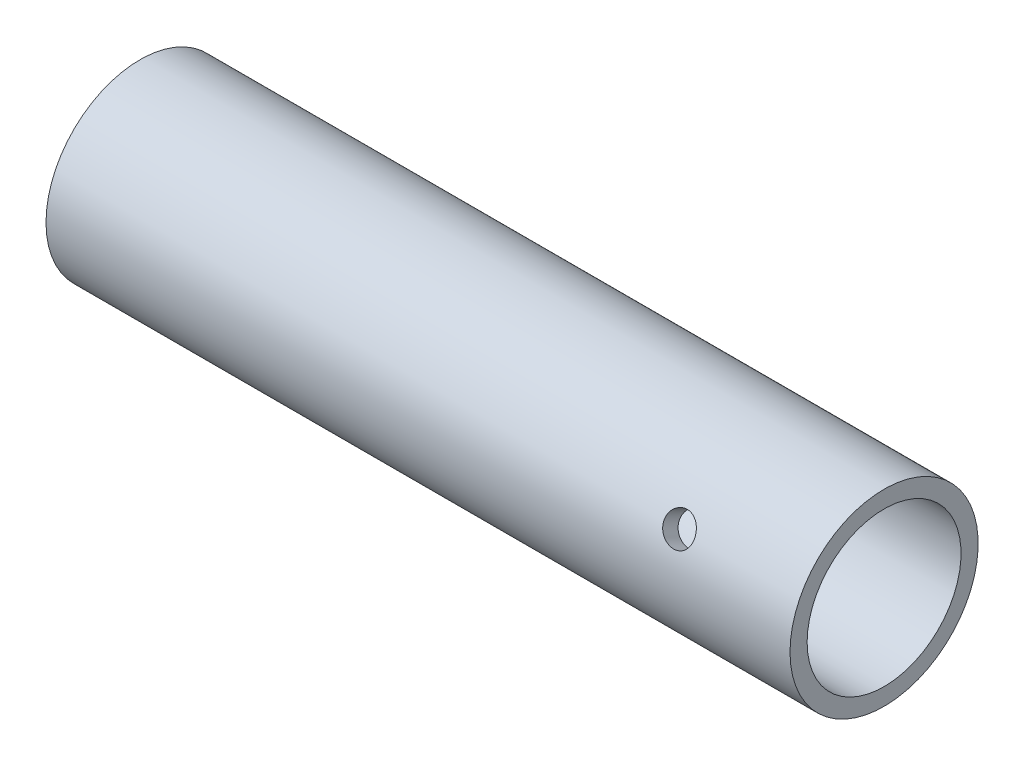
ISO-10303-21;
HEADER;
FILE_DESCRIPTION(('STEP AP214'),'2;1');
FILE_NAME('part.step','',(''),(''),'','','');
FILE_SCHEMA(('AUTOMOTIVE_DESIGN { 1 0 10303 214 1 1 1 1 }'));
ENDSEC;
DATA;
#1=APPLICATION_CONTEXT('core data for automotive mechanical design processes');
#2=APPLICATION_PROTOCOL_DEFINITION('international standard','automotive_design',2000,#1);
#3=PRODUCT_CONTEXT('',#1,'mechanical');
#4=PRODUCT('Part','Part','',(#3));
#5=PRODUCT_RELATED_PRODUCT_CATEGORY('part','',(#4));
#6=PRODUCT_DEFINITION_FORMATION('','',#4);
#7=PRODUCT_DEFINITION_CONTEXT('part definition',#1,'design');
#8=PRODUCT_DEFINITION('design','',#6,#7);
#9=PRODUCT_DEFINITION_SHAPE('','',#8);
#10=(LENGTH_UNIT() NAMED_UNIT(*) SI_UNIT(.MILLI.,.METRE.));
#11=(NAMED_UNIT(*) PLANE_ANGLE_UNIT() SI_UNIT($,.RADIAN.));
#12=(NAMED_UNIT(*) SI_UNIT($,.STERADIAN.) SOLID_ANGLE_UNIT());
#13=UNCERTAINTY_MEASURE_WITH_UNIT(LENGTH_MEASURE(1.E-05),#10,'distance_accuracy_value','');
#14=(GEOMETRIC_REPRESENTATION_CONTEXT(3) GLOBAL_UNCERTAINTY_ASSIGNED_CONTEXT((#13)) GLOBAL_UNIT_ASSIGNED_CONTEXT((#10,
#11,#12)) REPRESENTATION_CONTEXT('',''));
#15=CARTESIAN_POINT('',(0.,0.,0.));
#16=DIRECTION('',(0.,0.,1.));
#17=DIRECTION('',(1.,0.,0.));
#18=AXIS2_PLACEMENT_3D('',#15,#16,#17);
#19=CARTESIAN_POINT('',(261.558388757778,0.,0.));
#20=DIRECTION('',(-1.,0.,0.));
#21=DIRECTION('',(0.,0.,1.));
#22=AXIS2_PLACEMENT_3D('',#19,#20,#21);
#23=PLANE('',#22);
#24=CARTESIAN_POINT('',(261.558388757778,-148.573704322227,0.));
#25=DIRECTION('',(-1.,0.,0.));
#26=DIRECTION('',(0.,0.,1.));
#27=AXIS2_PLACEMENT_3D('',#24,#25,#26);
#28=CIRCLE('',#27,5.50000000000001);
#29=CARTESIAN_POINT('',(261.558388757778,-148.573704322227,5.50000000000001));
#30=VERTEX_POINT('',#29);
#31=EDGE_CURVE('E140',#30,#30,#28,.T.);
#32=ORIENTED_EDGE('',*,*,#31,.T.);
#33=EDGE_LOOP('',(#32));
#34=FACE_BOUND('',#33,.T.);
#35=CARTESIAN_POINT('',(261.558388757778,-148.573704322227,0.));
#36=DIRECTION('',(-1.,0.,0.));
#37=DIRECTION('',(0.,0.,1.));
#38=AXIS2_PLACEMENT_3D('',#35,#36,#37);
#39=CIRCLE('',#38,0.5);
#40=CARTESIAN_POINT('',(261.558388757778,-148.573704322227,0.5));
#41=VERTEX_POINT('',#40);
#42=EDGE_CURVE('E51',#41,#41,#39,.T.);
#43=ORIENTED_EDGE('',*,*,#42,.F.);
#44=EDGE_LOOP('',(#43));
#45=FACE_BOUND('',#44,.T.);
#46=ADVANCED_FACE('F38',(#34,#45),#23,.T.);
#47=CARTESIAN_POINT('',(263.058388757778,-148.573704322227,0.));
#48=DIRECTION('',(-1.,0.,0.));
#49=DIRECTION('',(0.,0.,1.));
#50=AXIS2_PLACEMENT_3D('',#47,#48,#49);
#51=CYLINDRICAL_SURFACE('',#50,0.5);
#52=ORIENTED_EDGE('',*,*,#42,.T.);
#53=EDGE_LOOP('',(#52));
#54=FACE_BOUND('',#53,.T.);
#55=CARTESIAN_POINT('',(263.058388757778,-148.573704322227,0.));
#56=DIRECTION('',(-1.,0.,0.));
#57=DIRECTION('',(0.,0.,1.));
#58=AXIS2_PLACEMENT_3D('',#55,#56,#57);
#59=CIRCLE('',#58,0.5);
#60=CARTESIAN_POINT('',(263.058388757778,-148.573704322227,0.5));
#61=VERTEX_POINT('',#60);
#62=EDGE_CURVE('E57',#61,#61,#59,.T.);
#63=ORIENTED_EDGE('',*,*,#62,.F.);
#64=EDGE_LOOP('',(#63));
#65=FACE_BOUND('',#64,.T.);
#66=ADVANCED_FACE('F105',(#54,#65),#51,.F.);
#67=CARTESIAN_POINT('',(263.058388757778,0.,0.));
#68=DIRECTION('',(-1.,0.,0.));
#69=DIRECTION('',(0.,0.,1.));
#70=AXIS2_PLACEMENT_3D('',#67,#68,#69);
#71=PLANE('',#70);
#72=CARTESIAN_POINT('',(263.058388757778,-148.573704322227,0.));
#73=DIRECTION('',(-1.,0.,0.));
#74=DIRECTION('',(0.,0.,1.));
#75=AXIS2_PLACEMENT_3D('',#72,#73,#74);
#76=CIRCLE('',#75,4.);
#77=CARTESIAN_POINT('',(263.058388757778,-148.573704322227,4.));
#78=VERTEX_POINT('',#77);
#79=EDGE_CURVE('E119',#78,#78,#76,.T.);
#80=ORIENTED_EDGE('',*,*,#79,.F.);
#81=EDGE_LOOP('',(#80));
#82=FACE_BOUND('',#81,.T.);
#83=ORIENTED_EDGE('',*,*,#62,.T.);
#84=EDGE_LOOP('',(#83));
#85=FACE_BOUND('',#84,.T.);
#86=ADVANCED_FACE('F102',(#82,#85),#71,.F.);
#87=CARTESIAN_POINT('',(263.058388757778,-148.573704322227,0.));
#88=DIRECTION('',(-1.,0.,0.));
#89=DIRECTION('',(0.,0.,1.));
#90=AXIS2_PLACEMENT_3D('',#87,#88,#89);
#91=CYLINDRICAL_SURFACE('',#90,4.);
#92=CARTESIAN_POINT('',(295.058388757778,-148.573704322227,0.));
#93=DIRECTION('',(-1.,0.,0.));
#94=DIRECTION('',(0.,0.,1.));
#95=AXIS2_PLACEMENT_3D('',#92,#93,#94);
#96=CIRCLE('',#95,4.);
#97=CARTESIAN_POINT('',(295.058388757778,-148.573704322227,4.));
#98=VERTEX_POINT('',#97);
#99=EDGE_CURVE('E124',#98,#98,#96,.T.);
#100=ORIENTED_EDGE('',*,*,#99,.F.);
#101=EDGE_LOOP('',(#100));
#102=FACE_BOUND('',#101,.T.);
#103=ORIENTED_EDGE('',*,*,#79,.T.);
#104=EDGE_LOOP('',(#103));
#105=FACE_BOUND('',#104,.T.);
#106=ADVANCED_FACE('F98',(#102,#105),#91,.F.);
#107=CARTESIAN_POINT('',(295.058388757778,0.,0.));
#108=DIRECTION('',(-1.,0.,0.));
#109=DIRECTION('',(0.,0.,1.));
#110=AXIS2_PLACEMENT_3D('',#107,#108,#109);
#111=PLANE('',#110);
#112=CARTESIAN_POINT('',(295.058388757778,-148.573704322227,0.));
#113=DIRECTION('',(-1.,0.,0.));
#114=DIRECTION('',(0.,0.,1.));
#115=AXIS2_PLACEMENT_3D('',#112,#113,#114);
#116=CIRCLE('',#115,4.5);
#117=CARTESIAN_POINT('',(295.058388757778,-148.573704322227,4.5));
#118=VERTEX_POINT('',#117);
#119=EDGE_CURVE('E130',#118,#118,#116,.T.);
#120=ORIENTED_EDGE('',*,*,#119,.F.);
#121=EDGE_LOOP('',(#120));
#122=FACE_BOUND('',#121,.T.);
#123=ORIENTED_EDGE('',*,*,#99,.T.);
#124=EDGE_LOOP('',(#123));
#125=FACE_BOUND('',#124,.T.);
#126=ADVANCED_FACE('F93',(#122,#125),#111,.F.);
#127=CARTESIAN_POINT('',(263.058388757778,-148.573704322227,0.));
#128=DIRECTION('',(-1.,0.,0.));
#129=DIRECTION('',(0.,0.,1.));
#130=AXIS2_PLACEMENT_3D('',#127,#128,#129);
#131=CYLINDRICAL_SURFACE('',#130,4.5);
#132=CARTESIAN_POINT('',(298.024345503325,-151.325180708403,-3.5608113817385));
#133=CARTESIAN_POINT('',(297.974337565391,-151.325179487366,-3.56081308925363));
#134=CARTESIAN_POINT('',(297.924306342349,-151.321805976729,-3.56342694902663));
#135=CARTESIAN_POINT('',(297.825659248718,-151.308380440811,-3.57373970951944));
#136=CARTESIAN_POINT('',(297.777044543157,-151.298323071642,-3.58144267906346));
#137=CARTESIAN_POINT('',(297.682671930298,-151.27176073818,-3.60149502460339));
#138=CARTESIAN_POINT('',(297.636911233943,-151.25526218672,-3.61383977879568));
#139=CARTESIAN_POINT('',(297.549438143099,-151.216162800501,-3.64252639047881));
#140=CARTESIAN_POINT('',(297.507725522841,-151.193562306326,-3.65886802487634));
#141=CARTESIAN_POINT('',(297.428940599855,-151.142386564057,-3.69497793568521));
#142=CARTESIAN_POINT('',(297.391933874229,-151.113739160253,-3.71478705097223));
#143=CARTESIAN_POINT('',(297.324183723104,-151.051233065395,-3.75676270188654));
#144=CARTESIAN_POINT('',(297.293440736649,-151.017374009333,-3.77892940259834));
#145=CARTESIAN_POINT('',(297.238836287459,-150.944854330806,-3.82485329986829));
#146=CARTESIAN_POINT('',(297.21503714089,-150.906154429375,-3.84862267542516));
#147=CARTESIAN_POINT('',(297.175398059981,-150.825111762915,-3.8965855194698));
#148=CARTESIAN_POINT('',(297.159557380614,-150.782769339314,-3.92077894804049));
#149=CARTESIAN_POINT('',(297.136489029067,-150.696125994574,-3.96834163127393));
#150=CARTESIAN_POINT('',(297.129150623511,-150.651858228956,-3.99171754506874));
#151=CARTESIAN_POINT('',(297.12294964667,-150.562088861675,-4.03718431421408));
#152=CARTESIAN_POINT('',(297.124086258643,-150.516587379325,-4.05927529318774));
#153=CARTESIAN_POINT('',(297.134719065518,-150.426340750113,-4.10124137574189));
#154=CARTESIAN_POINT('',(297.144095982776,-150.381594060146,-4.12114355509993));
#155=CARTESIAN_POINT('',(297.170754032538,-150.293523498529,-4.15866742202634));
#156=CARTESIAN_POINT('',(297.188035481297,-150.250199683882,-4.17628901831397));
#157=CARTESIAN_POINT('',(297.230122539457,-150.166003557219,-4.2091138934473));
#158=CARTESIAN_POINT('',(297.254974879319,-150.125148414996,-4.22430123237828));
#159=CARTESIAN_POINT('',(297.311463672837,-150.0474265026,-4.25204049156545));
#160=CARTESIAN_POINT('',(297.343100907118,-150.010560192087,-4.26459210824419));
#161=CARTESIAN_POINT('',(297.412915763222,-149.941362259278,-4.28729088838027));
#162=CARTESIAN_POINT('',(297.451197771381,-149.909120875615,-4.29739232953598));
#163=CARTESIAN_POINT('',(297.53287030153,-149.851033062093,-4.31501511751865));
#164=CARTESIAN_POINT('',(297.576260920119,-149.825186753188,-4.32253641554693));
#165=CARTESIAN_POINT('',(297.667064251964,-149.780763992802,-4.33515211828133));
#166=CARTESIAN_POINT('',(297.7144853742,-149.76220321797,-4.34024129472863));
#167=CARTESIAN_POINT('',(297.811919694676,-149.733147977461,-4.34809374616846));
#168=CARTESIAN_POINT('',(297.861932554182,-149.722652460497,-4.35085732430163));
#169=CARTESIAN_POINT('',(297.962213875524,-149.710258524392,-4.35411131709283));
#170=CARTESIAN_POINT('',(298.012463320204,-149.708216071313,-4.35463981922662));
#171=CARTESIAN_POINT('',(298.112588904204,-149.712414677733,-4.35354376125438));
#172=CARTESIAN_POINT('',(298.162465064532,-149.718655267515,-4.35191932323788));
#173=CARTESIAN_POINT('',(298.259937279588,-149.739069638718,-4.3464965564696));
#174=CARTESIAN_POINT('',(298.307550612057,-149.753166775759,-4.34271922229974));
#175=CARTESIAN_POINT('',(298.39970245445,-149.788708463296,-4.33290926963758));
#176=CARTESIAN_POINT('',(298.444240710717,-149.810153619051,-4.32687646535776));
#177=CARTESIAN_POINT('',(298.52961730228,-149.859958357799,-4.3123346065133));
#178=CARTESIAN_POINT('',(298.570399844995,-149.888404422082,-4.30379430070768));
#179=CARTESIAN_POINT('',(298.646522984125,-149.951100849852,-4.28414001138145));
#180=CARTESIAN_POINT('',(298.681863019749,-149.985351810707,-4.27302576293916));
#181=CARTESIAN_POINT('',(298.746651806592,-150.059125953844,-4.24794781845924));
#182=CARTESIAN_POINT('',(298.77600179251,-150.09872199877,-4.23394299958724));
#183=CARTESIAN_POINT('',(298.827276796674,-150.181502351108,-4.20320496384247));
#184=CARTESIAN_POINT('',(298.849202126735,-150.224686507734,-4.18647186159344));
#185=CARTESIAN_POINT('',(298.884861487897,-150.313025911255,-4.15054441615511));
#186=CARTESIAN_POINT('',(298.898641969728,-150.35816837308,-4.13136480363366));
#187=CARTESIAN_POINT('',(298.917767626222,-150.449250240534,-4.09082024818591));
#188=CARTESIAN_POINT('',(298.923113816853,-150.495189549502,-4.06945556879616));
#189=CARTESIAN_POINT('',(298.925179786191,-150.58567234346,-4.02547780298625));
#190=CARTESIAN_POINT('',(298.922048055735,-150.630226206963,-4.00289290955076));
#191=CARTESIAN_POINT('',(298.907574947832,-150.71750268239,-3.95683760349906));
#192=CARTESIAN_POINT('',(298.896233673611,-150.760225317332,-3.93336720202083));
#193=CARTESIAN_POINT('',(298.865729410442,-150.842626608376,-3.88641701301321));
#194=CARTESIAN_POINT('',(298.846584263006,-150.882311964221,-3.86293736814019));
#195=CARTESIAN_POINT('',(298.801034486127,-150.957807455327,-3.81680648061171));
#196=CARTESIAN_POINT('',(298.774629283011,-150.993617284042,-3.79415530358001));
#197=CARTESIAN_POINT('',(298.714808054969,-151.061126893735,-3.75025046831244));
#198=CARTESIAN_POINT('',(298.681285800576,-151.092751049986,-3.72902525052818));
#199=CARTESIAN_POINT('',(298.608400287238,-151.150543836463,-3.68932654823204));
#200=CARTESIAN_POINT('',(298.569035646803,-151.17671117284,-3.67085371662493));
#201=CARTESIAN_POINT('',(298.485074118294,-151.223300348617,-3.63737200260856));
#202=CARTESIAN_POINT('',(298.44042543828,-151.243657264214,-3.62240257551002));
#203=CARTESIAN_POINT('',(298.347506007355,-151.277798256743,-3.5969893781746));
#204=CARTESIAN_POINT('',(298.299238588497,-151.291588296327,-3.58654150320726));
#205=CARTESIAN_POINT('',(298.213109293432,-151.309661817043,-3.57276196233858));
#206=CARTESIAN_POINT('',(298.175738625764,-151.315473819414,-3.56829428018283));
#207=CARTESIAN_POINT('',(298.100364944226,-151.323233662607,-3.56231839186269));
#208=CARTESIAN_POINT('',(298.062361952201,-151.325181636644,-3.56081008367134));
#209=CARTESIAN_POINT('',(298.024345503325,-151.325180708403,-3.5608113817385));
#210=B_SPLINE_CURVE_WITH_KNOTS('',3,(#132,#133,#134,#135,#136,#137,#138,#139,#140,#141,#142,
#143,#144,#145,#146,#147,#148,#149,#150,#151,#152,#153,#154,#155,#156,#157,#158,#159,#160,#161,
#162,#163,#164,#165,#166,#167,#168,#169,#170,#171,#172,#173,#174,#175,#176,#177,#178,#179,#180,
#181,#182,#183,#184,#185,#186,#187,#188,#189,#190,#191,#192,#193,#194,#195,#196,#197,#198,#199,
#200,#201,#202,#203,#204,#205,#206,#207,#208,#209),.UNSPECIFIED.,.T.,.F.,(4,2,2,2,2,2,2,2,2,2,2,
2,2,2,2,2,2,2,2,2,2,2,2,2,2,2,2,2,2,2,2,2,2,2,2,2,2,2,4),(0.,0.149884617470893,
0.299889215333309,0.449744848123922,0.599592118351347,0.751340272913418,0.903099060296251,
1.05618060391445,1.20924781419646,1.36029823992516,1.51133410902368,1.66021910667929,
1.8091100616412,1.95893931797817,2.10878582190802,2.26124412083977,2.41370530308195,
2.56649276853244,2.71926031512168,2.86941382021882,3.01955881073331,3.16826407602735,
3.31698159316704,3.46763753794822,3.61830899580932,3.77129341557854,3.92427140964842,
4.07636832218533,4.22844691220213,4.37787915670964,4.52730952227829,4.67640015365657,
4.82550256918965,4.97701036820784,5.12855404998549,5.28173008718878,5.43476677577781,
5.54871423270953,5.66265776113543),.UNSPECIFIED.);
#211=CARTESIAN_POINT('',(298.024345503325,-151.325180708403,-3.5608113817385));
#212=VERTEX_POINT('',#211);
#213=EDGE_CURVE('E83',#212,#212,#210,.T.);
#214=ORIENTED_EDGE('',*,*,#213,.T.);
#215=EDGE_LOOP('',(#214));
#216=FACE_BOUND('',#215,.T.);
#217=CARTESIAN_POINT('',(298.024345503325,-147.437893399834,4.35430058087094));
#218=CARTESIAN_POINT('',(298.074353441258,-147.437891302093,4.3543006584609));
#219=CARTESIAN_POINT('',(298.1243846643,-147.433760411546,4.35322894011158));
#220=CARTESIAN_POINT('',(298.223031757931,-147.417391641382,4.3489090550466));
#221=CARTESIAN_POINT('',(298.271646463492,-147.405147274889,4.34565914680336));
#222=CARTESIAN_POINT('',(298.366019076351,-147.373039844229,4.33689746791208));
#223=CARTESIAN_POINT('',(298.411779772706,-147.353184358037,4.33138794665686));
#224=CARTESIAN_POINT('',(298.49925286355,-147.306579628293,4.31798336318693));
#225=CARTESIAN_POINT('',(298.540965483808,-147.279830769502,4.31008843411242));
#226=CARTESIAN_POINT('',(298.619750406794,-147.219968702417,4.29166521018968));
#227=CARTESIAN_POINT('',(298.65675713242,-147.186779063767,4.28110478029914));
#228=CARTESIAN_POINT('',(298.724507283546,-147.115348322401,4.25730107571439));
#229=CARTESIAN_POINT('',(298.75525027,-147.077106865897,4.24405761308815));
#230=CARTESIAN_POINT('',(298.80985471919,-146.996429886652,4.21474322866527));
#231=CARTESIAN_POINT('',(298.83365386576,-146.953960712962,4.19864866836665));
#232=CARTESIAN_POINT('',(298.873292946668,-146.866459715379,4.1638359750251));
#233=CARTESIAN_POINT('',(298.889133626035,-146.821428131804,4.14511808777372));
#234=CARTESIAN_POINT('',(298.912201977582,-146.730819875121,4.10562857213917));
#235=CARTESIAN_POINT('',(298.919540383138,-146.685258201583,4.08488725292225));
#236=CARTESIAN_POINT('',(298.925741359979,-146.59439750976,4.04164258758386));
#237=CARTESIAN_POINT('',(298.924604748006,-146.549098466588,4.01913941146038));
#238=CARTESIAN_POINT('',(298.913971941131,-146.460716328974,3.97337693862526));
#239=CARTESIAN_POINT('',(298.904595023873,-146.417610864316,3.95013297332698));
#240=CARTESIAN_POINT('',(298.877936974112,-146.334074468253,3.90337685131555));
#241=CARTESIAN_POINT('',(298.860655525352,-146.293643643934,3.87986468390853));
#242=CARTESIAN_POINT('',(298.818568467192,-146.216194477567,3.83330196489847));
#243=CARTESIAN_POINT('',(298.79371612733,-146.179199246452,3.81025525614079));
#244=CARTESIAN_POINT('',(298.737227333812,-146.109732626681,3.76570695758194));
#245=CARTESIAN_POINT('',(298.705590099531,-146.077261759277,3.74420554595252));
#246=CARTESIAN_POINT('',(298.635775243427,-146.016995075001,3.70332137675327));
#247=CARTESIAN_POINT('',(298.597493235268,-145.989290607923,3.68398207899208));
#248=CARTESIAN_POINT('',(298.515820705119,-145.939832980182,3.64878691179098));
#249=CARTESIAN_POINT('',(298.47243008653,-145.918079932081,3.63293110823702));
#250=CARTESIAN_POINT('',(298.381626754685,-145.880938769998,3.60548895681216));
#251=CARTESIAN_POINT('',(298.334205632449,-145.865564377284,3.59391181865276));
#252=CARTESIAN_POINT('',(298.236771311973,-145.841587509246,3.57571902354709));
#253=CARTESIAN_POINT('',(298.186758452467,-145.83298415133,3.56910271997058));
#254=CARTESIAN_POINT('',(298.086477131125,-145.822832111524,3.56128388316287));
#255=CARTESIAN_POINT('',(298.036227686445,-145.821165234424,3.55999065084798));
#256=CARTESIAN_POINT('',(297.936102102445,-145.824599404207,3.56264321882087));
#257=CARTESIAN_POINT('',(297.886225942118,-145.829700067314,3.56658872202899));
#258=CARTESIAN_POINT('',(297.788753727062,-145.846471634388,3.57942879558522));
#259=CARTESIAN_POINT('',(297.741140394592,-145.858079067985,3.58827554704888));
#260=CARTESIAN_POINT('',(297.648988552199,-145.887570477053,3.61040479275333));
#261=CARTESIAN_POINT('',(297.604450295932,-145.905454969569,3.62368765239549));
#262=CARTESIAN_POINT('',(297.519073704369,-145.947410658559,3.65421137794943));
#263=CARTESIAN_POINT('',(297.478291161654,-145.971559455897,3.67150157701125));
#264=CARTESIAN_POINT('',(297.402168022524,-146.025442186822,3.7091019021715));
#265=CARTESIAN_POINT('',(297.3668279869,-146.055176695255,3.72941233904924));
#266=CARTESIAN_POINT('',(297.302039200057,-146.120123801536,3.77246348166703));
#267=CARTESIAN_POINT('',(297.27268921414,-146.155413486633,3.79523670829717));
#268=CARTESIAN_POINT('',(297.221414209975,-146.230345675984,3.84195480515101));
#269=CARTESIAN_POINT('',(297.199488879914,-146.269987997347,3.86589962612278));
#270=CARTESIAN_POINT('',(297.163829518753,-146.352425394038,3.91384446084897));
#271=CARTESIAN_POINT('',(297.150049036921,-146.395200995959,3.93784336241643));
#272=CARTESIAN_POINT('',(297.130923380427,-146.482968801854,3.98513585445903));
#273=CARTESIAN_POINT('',(297.125577189796,-146.527960738183,4.00842952955196));
#274=CARTESIAN_POINT('',(297.123511220458,-146.618079231296,4.05314906764123));
#275=CARTESIAN_POINT('',(297.126642950914,-146.663189821936,4.07460037941262));
#276=CARTESIAN_POINT('',(297.141116058818,-146.752992251118,4.11551245698736));
#277=CARTESIAN_POINT('',(297.152457333038,-146.797684094918,4.13497324781614));
#278=CARTESIAN_POINT('',(297.182961596207,-146.88521429661,4.17148018969455));
#279=CARTESIAN_POINT('',(297.202106743643,-146.928056637446,4.18853172990496));
#280=CARTESIAN_POINT('',(297.247656520522,-147.010716662543,4.22007452959915));
#281=CARTESIAN_POINT('',(297.274061723638,-147.050534107467,4.23456558661128));
#282=CARTESIAN_POINT('',(297.33388295168,-147.12655040134,4.26114951082322));
#283=CARTESIAN_POINT('',(297.367405206073,-147.162680510869,4.2731999180347));
#284=CARTESIAN_POINT('',(297.440290719411,-147.229427906421,4.29466566562796));
#285=CARTESIAN_POINT('',(297.479655359846,-147.260043884773,4.30408038125062));
#286=CARTESIAN_POINT('',(297.563616888355,-147.31502212285,4.3204806803634));
#287=CARTESIAN_POINT('',(297.608265568369,-147.339313468298,4.32743900606621));
#288=CARTESIAN_POINT('',(297.701184999294,-147.380296451951,4.33892086221355));
#289=CARTESIAN_POINT('',(297.749452418153,-147.396994983723,4.34344660190208));
#290=CARTESIAN_POINT('',(297.835581713217,-147.418948757144,4.34932535433718));
#291=CARTESIAN_POINT('',(297.872952380885,-147.42603745359,4.35119349194274));
#292=CARTESIAN_POINT('',(297.948326062423,-147.435510491204,4.35368105419285));
#293=CARTESIAN_POINT('',(297.986329054448,-147.437894994554,4.35430052188641));
#294=CARTESIAN_POINT('',(298.024345503325,-147.437893399834,4.35430058087094));
#295=B_SPLINE_CURVE_WITH_KNOTS('',3,(#217,#218,#219,#220,#221,#222,#223,#224,#225,#226,#227,
#228,#229,#230,#231,#232,#233,#234,#235,#236,#237,#238,#239,#240,#241,#242,#243,#244,#245,#246,
#247,#248,#249,#250,#251,#252,#253,#254,#255,#256,#257,#258,#259,#260,#261,#262,#263,#264,#265,
#266,#267,#268,#269,#270,#271,#272,#273,#274,#275,#276,#277,#278,#279,#280,#281,#282,#283,#284,
#285,#286,#287,#288,#289,#290,#291,#292,#293,#294),.UNSPECIFIED.,.T.,.F.,(4,2,2,2,2,2,2,2,2,2,2,
2,2,2,2,2,2,2,2,2,2,2,2,2,2,2,2,2,2,2,2,2,2,2,2,2,2,2,4),(0.,0.149884617470836,
0.299889215333304,0.449744848123928,0.599592118351356,0.751340272913467,0.903099060296257,
1.05618060391447,1.20924781419648,1.36029823992515,1.51133410902364,1.66021910667927,
1.80911006164118,1.95893931797817,2.10878582190802,2.26124412083978,2.41370530308195,
2.56649276853244,2.71926031512162,2.86941382021882,3.01955881073326,3.16826407602729,
3.31698159316697,3.46763753794814,3.61830899580932,3.77129341557855,3.92427140964842,
4.07636832218533,4.22844691220212,4.37787915670965,4.52730952227825,4.67640015365652,
4.82550256918966,4.97701036820784,5.1285540499855,5.28173008718878,5.43476677577782,
5.54871423270953,5.66265776113543),.UNSPECIFIED.);
#296=CARTESIAN_POINT('',(298.024345503325,-147.437893399834,4.35430058087094));
#297=VERTEX_POINT('',#296);
#298=EDGE_CURVE('E76',#297,#297,#295,.T.);
#299=ORIENTED_EDGE('',*,*,#298,.T.);
#300=EDGE_LOOP('',(#299));
#301=FACE_BOUND('',#300,.T.);
#302=CARTESIAN_POINT('',(305.058388757778,-148.573704322227,0.));
#303=DIRECTION('',(-1.,0.,0.));
#304=DIRECTION('',(0.,0.,1.));
#305=AXIS2_PLACEMENT_3D('',#302,#303,#304);
#306=CIRCLE('',#305,4.5);
#307=CARTESIAN_POINT('',(305.058388757778,-148.573704322227,4.5));
#308=VERTEX_POINT('',#307);
#309=EDGE_CURVE('E134',#308,#308,#306,.T.);
#310=ORIENTED_EDGE('',*,*,#309,.F.);
#311=EDGE_LOOP('',(#310));
#312=FACE_BOUND('',#311,.T.);
#313=ORIENTED_EDGE('',*,*,#119,.T.);
#314=EDGE_LOOP('',(#313));
#315=FACE_BOUND('',#314,.T.);
#316=ADVANCED_FACE('F88',(#216,#301,#312,#315),#131,.F.);
#317=CARTESIAN_POINT('',(305.058388757778,0.,0.));
#318=DIRECTION('',(-1.,0.,0.));
#319=DIRECTION('',(0.,0.,1.));
#320=AXIS2_PLACEMENT_3D('',#317,#318,#319);
#321=PLANE('',#320);
#322=CARTESIAN_POINT('',(305.058388757778,-148.573704322227,0.));
#323=DIRECTION('',(-1.,0.,0.));
#324=DIRECTION('',(0.,0.,1.));
#325=AXIS2_PLACEMENT_3D('',#322,#323,#324);
#326=CIRCLE('',#325,5.50000000000001);
#327=CARTESIAN_POINT('',(305.058388757778,-148.573704322227,5.50000000000001));
#328=VERTEX_POINT('',#327);
#329=EDGE_CURVE('E137',#328,#328,#326,.T.);
#330=ORIENTED_EDGE('',*,*,#329,.F.);
#331=EDGE_LOOP('',(#330));
#332=FACE_BOUND('',#331,.T.);
#333=ORIENTED_EDGE('',*,*,#309,.T.);
#334=EDGE_LOOP('',(#333));
#335=FACE_BOUND('',#334,.T.);
#336=ADVANCED_FACE('F92',(#332,#335),#321,.F.);
#337=CARTESIAN_POINT('',(263.058388757778,-148.573704322227,0.));
#338=DIRECTION('',(-1.,0.,0.));
#339=DIRECTION('',(0.,0.,1.));
#340=AXIS2_PLACEMENT_3D('',#337,#338,#339);
#341=CYLINDRICAL_SURFACE('',#340,5.50000000000001);
#342=CARTESIAN_POINT('',(298.024345503325,-151.773406203702,-4.47346709719525));
#343=CARTESIAN_POINT('',(297.974156557219,-151.773404777524,-4.47346879447268));
#344=CARTESIAN_POINT('',(297.923939875965,-151.769935463772,-4.47595587816864));
#345=CARTESIAN_POINT('',(297.824914559823,-151.75612958702,-4.48578181438356));
#346=CARTESIAN_POINT('',(297.776107281926,-151.74578662185,-4.49312519005792));
#347=CARTESIAN_POINT('',(297.68134826817,-151.718477691048,-4.51228065682102));
#348=CARTESIAN_POINT('',(297.635394218832,-151.701517174603,-4.5240890709514));
#349=CARTESIAN_POINT('',(297.54757133804,-151.661352510584,-4.55159514855058));
#350=CARTESIAN_POINT('',(297.50570202829,-151.638149095212,-4.56729235590337));
#351=CARTESIAN_POINT('',(297.426833859571,-151.585779314774,-4.60199919593256));
#352=CARTESIAN_POINT('',(297.389879463522,-151.556563902153,-4.62103587139303));
#353=CARTESIAN_POINT('',(297.322276149414,-151.492941195773,-4.66148843264914));
#354=CARTESIAN_POINT('',(297.291627599837,-151.458533598814,-4.68290445736925));
#355=CARTESIAN_POINT('',(297.237339621703,-151.385106850761,-4.72735288501421));
#356=CARTESIAN_POINT('',(297.213741493632,-151.346062329582,-4.75039387120297));
#357=CARTESIAN_POINT('',(297.174489606077,-151.264489846517,-4.7970698105052));
#358=CARTESIAN_POINT('',(297.158835348456,-151.221962103249,-4.82070472627757));
#359=CARTESIAN_POINT('',(297.136051337993,-151.134942555995,-4.86749177702957));
#360=CARTESIAN_POINT('',(297.128846922522,-151.090471612161,-4.89064633689597));
#361=CARTESIAN_POINT('',(297.122934997698,-151.000457610748,-4.93593009085939));
#362=CARTESIAN_POINT('',(297.124226930703,-150.954914623725,-4.95805935215403));
#363=CARTESIAN_POINT('',(297.13521267161,-150.864519268105,-5.00046364539137));
#364=CARTESIAN_POINT('',(297.144826133028,-150.819664457538,-5.02075436540914));
#365=CARTESIAN_POINT('',(297.172055598317,-150.731522438264,-5.05926235646901));
#366=CARTESIAN_POINT('',(297.189671838985,-150.688235275984,-5.07747956613712));
#367=CARTESIAN_POINT('',(297.232487105802,-150.604333420702,-5.1116150060625));
#368=CARTESIAN_POINT('',(297.257719374582,-150.563731414849,-5.12752269545355));
#369=CARTESIAN_POINT('',(297.315026107551,-150.486641389096,-5.15677945738802));
#370=CARTESIAN_POINT('',(297.347101106015,-150.450153690779,-5.1701283299861));
#371=CARTESIAN_POINT('',(297.417628814257,-150.382027062365,-5.19435210784849));
#372=CARTESIAN_POINT('',(297.456151734018,-150.350449838919,-5.20519624952387));
#373=CARTESIAN_POINT('',(297.538244823875,-150.29370131062,-5.22422328633677));
#374=CARTESIAN_POINT('',(297.581815037332,-150.268530060806,-5.23240615860876));
#375=CARTESIAN_POINT('',(297.672844345568,-150.225436782245,-5.2461695189059));
#376=CARTESIAN_POINT('',(297.720307478465,-150.20752239837,-5.25174726345431));
#377=CARTESIAN_POINT('',(297.817731904565,-150.179633134245,-5.26034292382921));
#378=CARTESIAN_POINT('',(297.867692985828,-150.169657581628,-5.26336105643932));
#379=CARTESIAN_POINT('',(297.968078844297,-150.158087663157,-5.26685542288271));
#380=CARTESIAN_POINT('',(298.018491653965,-150.156398093083,-5.26736053181798));
#381=CARTESIAN_POINT('',(298.118888196654,-150.161205505763,-5.26591360102672));
#382=CARTESIAN_POINT('',(298.168871945556,-150.167702184184,-5.26396165264367));
#383=CARTESIAN_POINT('',(298.266681086876,-150.188574769028,-5.2575954660525));
#384=CARTESIAN_POINT('',(298.31451774099,-150.202902598304,-5.25319624925654));
#385=CARTESIAN_POINT('',(298.407031782527,-150.238893177491,-5.24189848265394));
#386=CARTESIAN_POINT('',(298.451708986925,-150.260556351917,-5.23499978819448));
#387=CARTESIAN_POINT('',(298.537073478101,-150.310703116922,-5.21857594170613));
#388=CARTESIAN_POINT('',(298.577721694372,-150.339245721986,-5.20902794947562));
#389=CARTESIAN_POINT('',(298.653470860067,-150.402107049572,-5.18729667089772));
#390=CARTESIAN_POINT('',(298.688571433603,-150.436426163165,-5.17511320611251));
#391=CARTESIAN_POINT('',(298.752586344163,-150.510122855327,-5.14799352157706));
#392=CARTESIAN_POINT('',(298.781435280302,-150.549547604699,-5.13303098225643));
#393=CARTESIAN_POINT('',(298.831670365891,-150.63194131225,-5.10055081279628));
#394=CARTESIAN_POINT('',(298.853056749953,-150.674910158956,-5.08303326300721));
#395=CARTESIAN_POINT('',(298.887657360101,-150.762871255906,-5.04577227118556));
#396=CARTESIAN_POINT('',(298.900906099614,-150.807854080303,-5.02603865556099));
#397=CARTESIAN_POINT('',(298.918966582066,-150.898641152942,-4.98469206084263));
#398=CARTESIAN_POINT('',(298.92377899315,-150.944445335845,-4.96307923072219));
#399=CARTESIAN_POINT('',(298.924811537373,-151.034977746043,-4.91880504369804));
#400=CARTESIAN_POINT('',(298.921131284319,-151.079712291717,-4.89615886603884));
#401=CARTESIAN_POINT('',(298.905498061628,-151.167397302068,-4.85027895644274));
#402=CARTESIAN_POINT('',(298.8935451343,-151.210347775868,-4.82704522751138));
#403=CARTESIAN_POINT('',(298.861743552554,-151.293283839325,-4.78080965721408));
#404=CARTESIAN_POINT('',(298.841903072629,-151.333272447855,-4.75780760097418));
#405=CARTESIAN_POINT('',(298.794900580801,-151.409350033151,-4.71286197009518));
#406=CARTESIAN_POINT('',(298.767738242141,-151.445438835778,-4.69091844274719));
#407=CARTESIAN_POINT('',(298.706508582818,-151.513257946551,-4.6487245068895));
#408=CARTESIAN_POINT('',(298.672368197392,-151.544935620303,-4.62849551479452));
#409=CARTESIAN_POINT('',(298.59830502363,-151.602748188854,-4.59086986192398));
#410=CARTESIAN_POINT('',(298.558380882692,-151.62888178357,-4.57347386570638));
#411=CARTESIAN_POINT('',(298.473562074801,-151.675177897784,-4.54220757226906));
#412=CARTESIAN_POINT('',(298.428635494741,-151.69529866324,-4.52836201988792));
#413=CARTESIAN_POINT('',(298.335321707811,-151.728857478771,-4.50504491574359));
#414=CARTESIAN_POINT('',(298.286938040173,-151.74230225444,-4.49556896260271));
#415=CARTESIAN_POINT('',(298.202691176517,-151.759284090378,-4.48354241819413));
#416=CARTESIAN_POINT('',(298.167340121586,-151.764573288262,-4.47977390001521));
#417=CARTESIAN_POINT('',(298.096112600645,-151.771634824807,-4.47473565399938));
#418=CARTESIAN_POINT('',(298.060236143626,-151.773407223576,-4.4734658834544));
#419=CARTESIAN_POINT('',(298.024345503325,-151.773406203702,-4.47346709719525));
#420=B_SPLINE_CURVE_WITH_KNOTS('',3,(#342,#343,#344,#345,#346,#347,#348,#349,#350,#351,#352,
#353,#354,#355,#356,#357,#358,#359,#360,#361,#362,#363,#364,#365,#366,#367,#368,#369,#370,#371,
#372,#373,#374,#375,#376,#377,#378,#379,#380,#381,#382,#383,#384,#385,#386,#387,#388,#389,#390,
#391,#392,#393,#394,#395,#396,#397,#398,#399,#400,#401,#402,#403,#404,#405,#406,#407,#408,#409,
#410,#411,#412,#413,#414,#415,#416,#417,#418,#419),.UNSPECIFIED.,.T.,.F.,(4,2,2,2,2,2,2,2,2,2,2,
2,2,2,2,2,2,2,2,2,2,2,2,2,2,2,2,2,2,2,2,2,2,2,2,2,2,2,4),(0.,0.15043560450601,0.301011522603146,
0.451463710562467,0.601898260353318,0.753612555565504,0.905335713669842,1.05793096506343,
1.21051664648834,1.3617436767699,1.51296078163665,1.66273392912541,1.8125115086091,
1.96295253437674,2.11340531078296,2.26561789026912,2.41783177752571,2.57020560276713,
2.72256652157978,2.87317267610218,3.02377323186187,3.17345943666684,3.32315430567892,
3.47418212718167,3.62522017740647,3.77776923221489,3.93031349066546,4.08220622765063,
4.23408693440928,4.38419524130205,4.53430278049206,4.68425515527595,4.83421422317684,
4.98583227264653,5.13748583727442,5.29016926326828,5.44269855766489,5.55027847064738,
5.65785654488108),.UNSPECIFIED.);
#421=CARTESIAN_POINT('',(298.024345503325,-151.773406203702,-4.47346709719525));
#422=VERTEX_POINT('',#421);
#423=EDGE_CURVE('E41',#422,#422,#420,.T.);
#424=ORIENTED_EDGE('',*,*,#423,.F.);
#425=EDGE_LOOP('',(#424));
#426=FACE_BOUND('',#425,.T.);
#427=CARTESIAN_POINT('',(298.024345503325,-146.989667904535,5.26695629632769));
#428=CARTESIAN_POINT('',(298.07453444943,-146.989665689484,5.26695620531688));
#429=CARTESIAN_POINT('',(298.124751130684,-146.98557655671,5.2657311680229));
#430=CARTESIAN_POINT('',(298.223776446826,-146.969360524254,5.26081267772905));
#431=CARTESIAN_POINT('',(298.272583724723,-146.957226131182,5.25711692346579));
#432=CARTESIAN_POINT('',(298.367342738479,-146.925372033285,5.24721611260639));
#433=CARTESIAN_POINT('',(298.413296787817,-146.9056585696,5.24101312043114));
#434=CARTESIAN_POINT('',(298.501119668609,-146.859336824899,5.22604380152686));
#435=CARTESIAN_POINT('',(298.542988978359,-146.832729352463,5.21727777539401));
#436=CARTESIAN_POINT('',(298.621857147078,-146.773247661731,5.19705187329944));
#437=CARTESIAN_POINT('',(298.658811543128,-146.740322057835,5.18556971516808));
#438=CARTESIAN_POINT('',(298.726414857235,-146.669414005897,5.15995123259179));
#439=CARTESIAN_POINT('',(298.757063406812,-146.631431262554,5.14581475313415));
#440=CARTESIAN_POINT('',(298.811351384946,-146.55136738979,5.11488052730475));
#441=CARTESIAN_POINT('',(298.834949513017,-146.509263958051,5.09806795122117));
#442=CARTESIAN_POINT('',(298.874201400572,-146.422457473844,5.06204923938043));
#443=CARTESIAN_POINT('',(298.889855658193,-146.377754584575,5.04284325380083));
#444=CARTESIAN_POINT('',(298.912639668656,-146.287530148556,5.00258184712725));
#445=CARTESIAN_POINT('',(298.919844084127,-146.24201943553,4.98154441648652));
#446=CARTESIAN_POINT('',(298.925756008951,-146.151154020472,4.93799427102408));
#447=CARTESIAN_POINT('',(298.924464075946,-146.105799308397,4.91548165311965));
#448=CARTESIAN_POINT('',(298.913478335039,-146.016979462922,4.86986938007071));
#449=CARTESIAN_POINT('',(298.903864873621,-145.973500421634,4.84677738322263));
#450=CARTESIAN_POINT('',(298.876635408332,-145.889141537982,4.8005663489767));
#451=CARTESIAN_POINT('',(298.859019167664,-145.848261772571,4.7774473107989));
#452=CARTESIAN_POINT('',(298.816203900847,-145.769955370253,4.73191867217544));
#453=CARTESIAN_POINT('',(298.790971632067,-145.732544831226,4.70951266783026));
#454=CARTESIAN_POINT('',(298.733664899098,-145.662263610389,4.66639213690718));
#455=CARTESIAN_POINT('',(298.701589900634,-145.629393283406,4.64567774258382));
#456=CARTESIAN_POINT('',(298.631062192392,-145.568574701549,4.60657366333547));
#457=CARTESIAN_POINT('',(298.592539272631,-145.540688515836,4.58821400387204));
#458=CARTESIAN_POINT('',(298.510446182774,-145.490938375174,4.55493717863078));
#459=CARTESIAN_POINT('',(298.466875969317,-145.469074471968,4.54002004243131));
#460=CARTESIAN_POINT('',(298.375846661081,-145.431837861361,4.51433160973578));
#461=CARTESIAN_POINT('',(298.328383528184,-145.416471998691,4.50356468592965));
#462=CARTESIAN_POINT('',(298.230959102084,-145.392619791238,4.48674896024399));
#463=CARTESIAN_POINT('',(298.180998020821,-145.384132863853,4.48069975880547));
#464=CARTESIAN_POINT('',(298.080612162352,-145.374294357506,4.47367997226095));
#465=CARTESIAN_POINT('',(298.030199352684,-145.372861725379,4.47265169833985));
#466=CARTESIAN_POINT('',(297.929802809995,-145.376945753175,4.47557155147773));
#467=CARTESIAN_POINT('',(297.879819061093,-145.382462154761,4.47951949354111));
#468=CARTESIAN_POINT('',(297.782009919773,-145.400260437793,4.49214542918603));
#469=CARTESIAN_POINT('',(297.73417326566,-145.412501040198,4.50079455937101));
#470=CARTESIAN_POINT('',(297.641659224122,-145.443444281347,4.52236947878178));
#471=CARTESIAN_POINT('',(297.596982019724,-145.46214729409,4.53529551552218));
#472=CARTESIAN_POINT('',(297.511617528548,-145.505801419513,4.56493936998564));
#473=CARTESIAN_POINT('',(297.470969312277,-145.530806685219,4.5816899265853));
#474=CARTESIAN_POINT('',(297.395220146582,-145.586433885315,4.61815099601751));
#475=CARTESIAN_POINT('',(297.360119573046,-145.617056199991,4.63786170924336));
#476=CARTESIAN_POINT('',(297.296104662486,-145.683571721078,4.67960335726313));
#477=CARTESIAN_POINT('',(297.267255726347,-145.719514593423,4.70165553115924));
#478=CARTESIAN_POINT('',(297.217020640758,-145.795589075952,4.74700261000856));
#479=CARTESIAN_POINT('',(297.195634256696,-145.835720554401,4.77029747586676));
#480=CARTESIAN_POINT('',(297.161033646548,-145.918981999609,4.81712767798102));
#481=CARTESIAN_POINT('',(297.147784907035,-145.96209842766,4.84066156224186));
#482=CARTESIAN_POINT('',(297.129724424583,-146.050320719645,4.88723044294679));
#483=CARTESIAN_POINT('',(297.124912013499,-146.095426425741,4.91026547875623));
#484=CARTESIAN_POINT('',(297.123879469276,-146.185809829075,4.95484306656281));
#485=CARTESIAN_POINT('',(297.12755972233,-146.231079376667,4.9763998984282));
#486=CARTESIAN_POINT('',(297.143192945021,-146.320992757811,5.0177425040082));
#487=CARTESIAN_POINT('',(297.155145872349,-146.365636594561,5.03752828678002));
#488=CARTESIAN_POINT('',(297.186947454095,-146.452928200344,5.07489530622839));
#489=CARTESIAN_POINT('',(297.20678793402,-146.495577984984,5.09247880057709));
#490=CARTESIAN_POINT('',(297.253790425848,-146.577655897071,5.12520684767793));
#491=CARTESIAN_POINT('',(297.280952764508,-146.617083880634,5.14035129153299));
#492=CARTESIAN_POINT('',(297.342182423831,-146.691935437873,5.16822608997614));
#493=CARTESIAN_POINT('',(297.376322809257,-146.72730988568,5.18092788425263));
#494=CARTESIAN_POINT('',(297.450385983019,-146.7924288338,5.20367662998036));
#495=CARTESIAN_POINT('',(297.490310123957,-146.822172013408,5.21372295886173));
#496=CARTESIAN_POINT('',(297.575128931848,-146.875217881728,5.23124571979734));
#497=CARTESIAN_POINT('',(297.620055511908,-146.898475462192,5.23870423668991));
#498=CARTESIAN_POINT('',(297.713369298838,-146.937443759177,5.25100680859609));
#499=CARTESIAN_POINT('',(297.761752966476,-146.953162070443,5.25585349526855));
#500=CARTESIAN_POINT('',(297.845999830132,-146.973061188549,5.26194000665221));
#501=CARTESIAN_POINT('',(297.881350885063,-146.979276977704,5.2638218431762));
#502=CARTESIAN_POINT('',(297.952578406004,-146.987581092428,5.26633000982609));
#503=CARTESIAN_POINT('',(297.988454863023,-146.989669488541,5.26695636141047));
#504=CARTESIAN_POINT('',(298.024345503325,-146.989667904535,5.26695629632769));
#505=B_SPLINE_CURVE_WITH_KNOTS('',3,(#427,#428,#429,#430,#431,#432,#433,#434,#435,#436,#437,
#438,#439,#440,#441,#442,#443,#444,#445,#446,#447,#448,#449,#450,#451,#452,#453,#454,#455,#456,
#457,#458,#459,#460,#461,#462,#463,#464,#465,#466,#467,#468,#469,#470,#471,#472,#473,#474,#475,
#476,#477,#478,#479,#480,#481,#482,#483,#484,#485,#486,#487,#488,#489,#490,#491,#492,#493,#494,
#495,#496,#497,#498,#499,#500,#501,#502,#503,#504),.UNSPECIFIED.,.T.,.F.,(4,2,2,2,2,2,2,2,2,2,2,
2,2,2,2,2,2,2,2,2,2,2,2,2,2,2,2,2,2,2,2,2,2,2,2,2,2,2,4),(0.,0.150435604506013,
0.301011522603149,0.451463710562526,0.601898260353309,0.753612555565498,0.905335713669831,
1.05793096506338,1.21051664648834,1.3617436767699,1.51296078163664,1.66273392912543,
1.8125115086091,1.96295253437674,2.11340531078297,2.26561789026919,2.41783177752576,
2.57020560276713,2.72256652157977,2.87317267610229,3.02377323186187,3.17345943666677,
3.32315430567894,3.47418212718173,3.62522017740655,3.77776923221497,3.93031349066543,
4.08220622765061,4.23408693440929,4.38419524130209,4.53430278049204,4.68425515527592,
4.83421422317685,4.98583227264653,5.13748583727438,5.29016926326825,5.44269855766496,
5.5502784706474,5.65785654488109),.UNSPECIFIED.);
#506=CARTESIAN_POINT('',(298.024345503325,-146.989667904535,5.26695629632769));
#507=VERTEX_POINT('',#506);
#508=EDGE_CURVE('E10',#507,#507,#505,.T.);
#509=ORIENTED_EDGE('',*,*,#508,.F.);
#510=EDGE_LOOP('',(#509));
#511=FACE_BOUND('',#510,.T.);
#512=ORIENTED_EDGE('',*,*,#329,.T.);
#513=EDGE_LOOP('',(#512));
#514=FACE_BOUND('',#513,.T.);
#515=ORIENTED_EDGE('',*,*,#31,.F.);
#516=EDGE_LOOP('',(#515));
#517=FACE_BOUND('',#516,.T.);
#518=ADVANCED_FACE('F63',(#426,#511,#514,#517),#341,.T.);
#519=CARTESIAN_POINT('',(298.024345503325,-151.818769174803,-6.60744874129836));
#520=DIRECTION('',(0.,0.440827332851372,0.897591924323713));
#521=DIRECTION('',(0.,-0.897591924323713,0.440827332851372));
#522=AXIS2_PLACEMENT_3D('',#519,#520,#521);
#523=CYLINDRICAL_SURFACE('',#522,0.900000000000003);
#524=ORIENTED_EDGE('',*,*,#508,.T.);
#525=EDGE_LOOP('',(#524));
#526=FACE_BOUND('',#525,.T.);
#527=ORIENTED_EDGE('',*,*,#298,.F.);
#528=EDGE_LOOP('',(#527));
#529=FACE_BOUND('',#528,.T.);
#530=ADVANCED_FACE('F69',(#526,#529),#523,.F.);
#531=ORIENTED_EDGE('',*,*,#423,.T.);
#532=EDGE_LOOP('',(#531));
#533=FACE_BOUND('',#532,.T.);
#534=ORIENTED_EDGE('',*,*,#213,.F.);
#535=EDGE_LOOP('',(#534));
#536=FACE_BOUND('',#535,.T.);
#537=ADVANCED_FACE('F66',(#533,#536),#523,.F.);
#538=CLOSED_SHELL('',(#46,#66,#86,#106,#126,#316,#336,#518,#530,#537));
#539=MANIFOLD_SOLID_BREP('B2',#538);
#540=ADVANCED_BREP_SHAPE_REPRESENTATION('',(#18,#539),#14);
#541=SHAPE_DEFINITION_REPRESENTATION(#9,#540);
ENDSEC;
END-ISO-10303-21;
